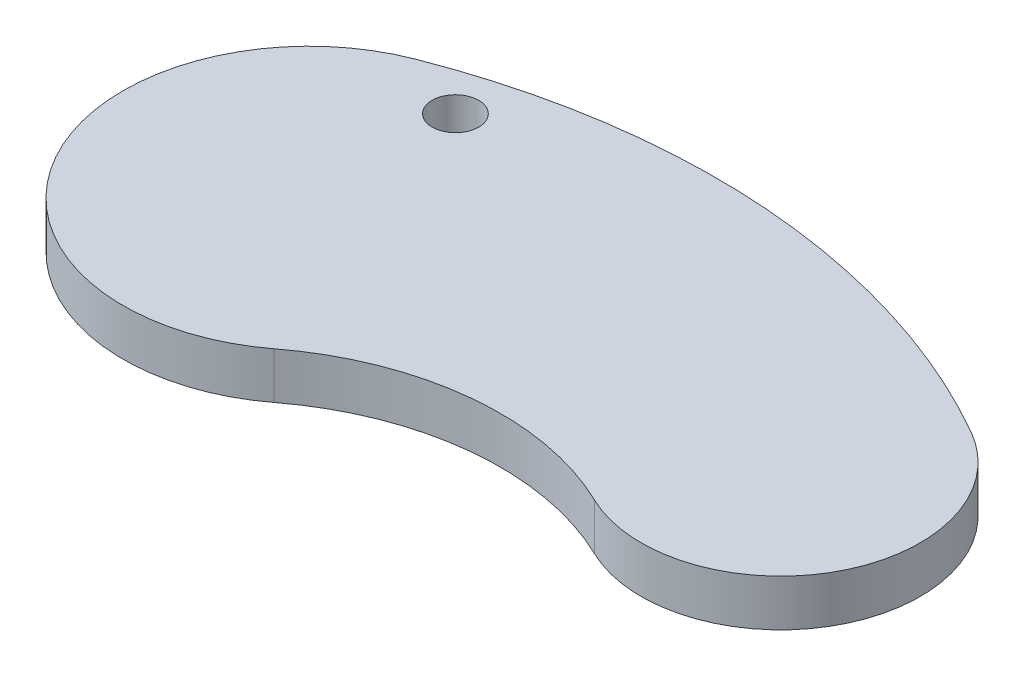
ISO-10303-21;
HEADER;
FILE_DESCRIPTION(('STEP AP214'),'2;1');
FILE_NAME('part.step','',(''),(''),'','','');
FILE_SCHEMA(('AUTOMOTIVE_DESIGN { 1 0 10303 214 1 1 1 1 }'));
ENDSEC;
DATA;
#1=APPLICATION_CONTEXT('core data for automotive mechanical design processes');
#2=APPLICATION_PROTOCOL_DEFINITION('international standard','automotive_design',2000,#1);
#3=PRODUCT_CONTEXT('',#1,'mechanical');
#4=PRODUCT('Part','Part','',(#3));
#5=PRODUCT_RELATED_PRODUCT_CATEGORY('part','',(#4));
#6=PRODUCT_DEFINITION_FORMATION('','',#4);
#7=PRODUCT_DEFINITION_CONTEXT('part definition',#1,'design');
#8=PRODUCT_DEFINITION('design','',#6,#7);
#9=PRODUCT_DEFINITION_SHAPE('','',#8);
#10=(LENGTH_UNIT() NAMED_UNIT(*) SI_UNIT(.MILLI.,.METRE.));
#11=(NAMED_UNIT(*) PLANE_ANGLE_UNIT() SI_UNIT($,.RADIAN.));
#12=(NAMED_UNIT(*) SI_UNIT($,.STERADIAN.) SOLID_ANGLE_UNIT());
#13=UNCERTAINTY_MEASURE_WITH_UNIT(LENGTH_MEASURE(1.E-05),#10,'distance_accuracy_value','');
#14=(GEOMETRIC_REPRESENTATION_CONTEXT(3) GLOBAL_UNCERTAINTY_ASSIGNED_CONTEXT((#13)) GLOBAL_UNIT_ASSIGNED_CONTEXT((#10,
#11,#12)) REPRESENTATION_CONTEXT('',''));
#15=CARTESIAN_POINT('',(0.,0.,0.));
#16=DIRECTION('',(0.,0.,1.));
#17=DIRECTION('',(1.,0.,0.));
#18=AXIS2_PLACEMENT_3D('',#15,#16,#17);
#19=CARTESIAN_POINT('',(199.810410977494,50.,512.421505857244));
#20=DIRECTION('',(0.,-1.,0.));
#21=DIRECTION('',(0.,0.,-1.));
#22=AXIS2_PLACEMENT_3D('',#19,#20,#21);
#23=CYLINDRICAL_SURFACE('',#22,750.);
#24=CARTESIAN_POINT('',(199.810410977494,0.,512.421505857244));
#25=DIRECTION('',(0.,1.,0.));
#26=DIRECTION('',(0.,0.,-1.));
#27=AXIS2_PLACEMENT_3D('',#24,#25,#26);
#28=CIRCLE('',#27,750.);
#29=CARTESIAN_POINT('',(573.958412065811,0.,-137.588704279195));
#30=VERTEX_POINT('',#29);
#31=CARTESIAN_POINT('',(-72.6583312645432,0.,-186.335093038998));
#32=VERTEX_POINT('',#31);
#33=EDGE_CURVE('E95',#30,#32,#28,.T.);
#34=ORIENTED_EDGE('',*,*,#33,.T.);
#35=DIRECTION('',(0.,-1.,0.));
#36=VECTOR('',#35,1.);
#37=CARTESIAN_POINT('',(-72.6583312645432,50.,-186.335093038998));
#38=LINE('',#37,#36);
#39=CARTESIAN_POINT('',(-72.6583312645432,50.,-186.335093038998));
#40=VERTEX_POINT('',#39);
#41=EDGE_CURVE('E11',#40,#32,#38,.T.);
#42=ORIENTED_EDGE('',*,*,#41,.F.);
#43=CARTESIAN_POINT('',(199.810410977494,50.,512.421505857244));
#44=DIRECTION('',(0.,1.,0.));
#45=DIRECTION('',(0.,0.,-1.));
#46=AXIS2_PLACEMENT_3D('',#43,#44,#45);
#47=CIRCLE('',#46,750.);
#48=CARTESIAN_POINT('',(573.958412065811,50.,-137.588704279195));
#49=VERTEX_POINT('',#48);
#50=EDGE_CURVE('E83',#49,#40,#47,.T.);
#51=ORIENTED_EDGE('',*,*,#50,.F.);
#52=DIRECTION('',(0.,-1.,0.));
#53=VECTOR('',#52,1.);
#54=CARTESIAN_POINT('',(573.958412065811,50.,-137.588704279195));
#55=LINE('',#54,#53);
#56=EDGE_CURVE('E91',#49,#30,#55,.T.);
#57=ORIENTED_EDGE('',*,*,#56,.T.);
#58=EDGE_LOOP('',(#34,#42,#51,#57));
#59=FACE_BOUND('',#58,.T.);
#60=ADVANCED_FACE('F32',(#59),#23,.T.);
#61=CARTESIAN_POINT('',(0.,50.,0.));
#62=DIRECTION('',(0.,-1.,0.));
#63=DIRECTION('',(0.,0.,-1.));
#64=AXIS2_PLACEMENT_3D('',#61,#62,#63);
#65=CYLINDRICAL_SURFACE('',#64,200.);
#66=CARTESIAN_POINT('',(0.,0.,0.));
#67=DIRECTION('',(0.,1.,0.));
#68=DIRECTION('',(0.,0.,1.));
#69=AXIS2_PLACEMENT_3D('',#66,#67,#68);
#70=CIRCLE('',#69,200.);
#71=CARTESIAN_POINT('',(121.299023103566,0.,159.017442421014));
#72=VERTEX_POINT('',#71);
#73=EDGE_CURVE('E87',#32,#72,#70,.T.);
#74=ORIENTED_EDGE('',*,*,#73,.T.);
#75=DIRECTION('',(0.,-1.,0.));
#76=VECTOR('',#75,1.);
#77=CARTESIAN_POINT('',(121.299023103566,50.,159.017442421014));
#78=LINE('',#77,#76);
#79=CARTESIAN_POINT('',(121.299023103566,50.,159.017442421014));
#80=VERTEX_POINT('',#79);
#81=EDGE_CURVE('E40',#80,#72,#78,.T.);
#82=ORIENTED_EDGE('',*,*,#81,.F.);
#83=CARTESIAN_POINT('',(0.,50.,0.));
#84=DIRECTION('',(0.,1.,0.));
#85=DIRECTION('',(0.,0.,1.));
#86=AXIS2_PLACEMENT_3D('',#83,#84,#85);
#87=CIRCLE('',#86,200.);
#88=EDGE_CURVE('E78',#40,#80,#87,.T.);
#89=ORIENTED_EDGE('',*,*,#88,.F.);
#90=ORIENTED_EDGE('',*,*,#41,.T.);
#91=EDGE_LOOP('',(#74,#82,#89,#90));
#92=FACE_BOUND('',#91,.T.);
#93=ADVANCED_FACE('F86',(#92),#65,.T.);
#94=CARTESIAN_POINT('',(303.247557758915,50.,397.543606052535));
#95=DIRECTION('',(0.,-1.,0.));
#96=DIRECTION('',(0.,0.,-1.));
#97=AXIS2_PLACEMENT_3D('',#94,#95,#96);
#98=CYLINDRICAL_SURFACE('',#97,300.);
#99=CARTESIAN_POINT('',(303.247557758915,0.,397.543606052535));
#100=DIRECTION('',(0.,-1.,0.));
#101=DIRECTION('',(0.,0.,-1.));
#102=AXIS2_PLACEMENT_3D('',#99,#100,#101);
#103=CIRCLE('',#102,300.);
#104=CARTESIAN_POINT('',(433.83506048507,0.,127.45676051624));
#105=VERTEX_POINT('',#104);
#106=EDGE_CURVE('E65',#72,#105,#103,.T.);
#107=ORIENTED_EDGE('',*,*,#106,.T.);
#108=DIRECTION('',(0.,-1.,0.));
#109=VECTOR('',#108,1.);
#110=CARTESIAN_POINT('',(433.83506048507,50.,127.45676051624));
#111=LINE('',#110,#109);
#112=CARTESIAN_POINT('',(433.83506048507,50.,127.45676051624));
#113=VERTEX_POINT('',#112);
#114=EDGE_CURVE('E88',#113,#105,#111,.T.);
#115=ORIENTED_EDGE('',*,*,#114,.F.);
#116=CARTESIAN_POINT('',(303.247557758915,50.,397.543606052535));
#117=DIRECTION('',(0.,-1.,0.));
#118=DIRECTION('',(0.,0.,-1.));
#119=AXIS2_PLACEMENT_3D('',#116,#117,#118);
#120=CIRCLE('',#119,300.);
#121=EDGE_CURVE('E81',#80,#113,#120,.T.);
#122=ORIENTED_EDGE('',*,*,#121,.F.);
#123=ORIENTED_EDGE('',*,*,#81,.T.);
#124=EDGE_LOOP('',(#107,#115,#122,#123));
#125=FACE_BOUND('',#124,.T.);
#126=ADVANCED_FACE('F89',(#125),#98,.F.);
#127=CARTESIAN_POINT('',(499.128811848147,50.,-7.58666225190716));
#128=DIRECTION('',(0.,-1.,0.));
#129=DIRECTION('',(0.,0.,-1.));
#130=AXIS2_PLACEMENT_3D('',#127,#128,#129);
#131=CYLINDRICAL_SURFACE('',#130,150.);
#132=CARTESIAN_POINT('',(499.128811848147,0.,-7.58666225190716));
#133=DIRECTION('',(0.,1.,0.));
#134=DIRECTION('',(0.,0.,1.));
#135=AXIS2_PLACEMENT_3D('',#132,#133,#134);
#136=CIRCLE('',#135,150.);
#137=EDGE_CURVE('E71',#105,#30,#136,.T.);
#138=ORIENTED_EDGE('',*,*,#137,.T.);
#139=ORIENTED_EDGE('',*,*,#56,.F.);
#140=CARTESIAN_POINT('',(499.128811848147,50.,-7.58666225190716));
#141=DIRECTION('',(0.,1.,0.));
#142=DIRECTION('',(0.,0.,1.));
#143=AXIS2_PLACEMENT_3D('',#140,#141,#142);
#144=CIRCLE('',#143,150.);
#145=EDGE_CURVE('E48',#113,#49,#144,.T.);
#146=ORIENTED_EDGE('',*,*,#145,.F.);
#147=ORIENTED_EDGE('',*,*,#114,.T.);
#148=EDGE_LOOP('',(#138,#139,#146,#147));
#149=FACE_BOUND('',#148,.T.);
#150=ADVANCED_FACE('F103',(#149),#131,.T.);
#151=CARTESIAN_POINT('',(349.469611412821,50.,252.417421802668));
#152=DIRECTION('',(0.,-1.,0.));
#153=DIRECTION('',(0.,0.,-1.));
#154=AXIS2_PLACEMENT_3D('',#151,#152,#153);
#155=PLANE('',#154);
#156=CARTESIAN_POINT('',(0.,50.,-157.158916996707));
#157=DIRECTION('',(0.,1.,0.));
#158=DIRECTION('',(0.,0.,1.));
#159=AXIS2_PLACEMENT_3D('',#156,#157,#158);
#160=CIRCLE('',#159,25.);
#161=CARTESIAN_POINT('',(0.,50.,-132.158916996707));
#162=VERTEX_POINT('',#161);
#163=EDGE_CURVE('E109',#162,#162,#160,.T.);
#164=ORIENTED_EDGE('',*,*,#163,.F.);
#165=EDGE_LOOP('',(#164));
#166=FACE_BOUND('',#165,.T.);
#167=ORIENTED_EDGE('',*,*,#50,.T.);
#168=ORIENTED_EDGE('',*,*,#88,.T.);
#169=ORIENTED_EDGE('',*,*,#121,.T.);
#170=ORIENTED_EDGE('',*,*,#145,.T.);
#171=EDGE_LOOP('',(#167,#168,#169,#170));
#172=FACE_BOUND('',#171,.T.);
#173=ADVANCED_FACE('F79',(#166,#172),#155,.F.);
#174=CARTESIAN_POINT('',(349.469611412821,0.,252.417421802668));
#175=DIRECTION('',(0.,-1.,0.));
#176=DIRECTION('',(0.,0.,-1.));
#177=AXIS2_PLACEMENT_3D('',#174,#175,#176);
#178=PLANE('',#177);
#179=CARTESIAN_POINT('',(0.,0.,-157.158916996707));
#180=DIRECTION('',(0.,1.,0.));
#181=DIRECTION('',(0.,0.,1.));
#182=AXIS2_PLACEMENT_3D('',#179,#180,#181);
#183=CIRCLE('',#182,25.);
#184=CARTESIAN_POINT('',(0.,0.,-132.158916996707));
#185=VERTEX_POINT('',#184);
#186=EDGE_CURVE('E98',#185,#185,#183,.T.);
#187=ORIENTED_EDGE('',*,*,#186,.T.);
#188=EDGE_LOOP('',(#187));
#189=FACE_BOUND('',#188,.T.);
#190=ORIENTED_EDGE('',*,*,#33,.F.);
#191=ORIENTED_EDGE('',*,*,#137,.F.);
#192=ORIENTED_EDGE('',*,*,#106,.F.);
#193=ORIENTED_EDGE('',*,*,#73,.F.);
#194=EDGE_LOOP('',(#190,#191,#192,#193));
#195=FACE_BOUND('',#194,.T.);
#196=ADVANCED_FACE('F106',(#189,#195),#178,.T.);
#197=CARTESIAN_POINT('',(0.,0.,-157.158916996707));
#198=DIRECTION('',(0.,1.,0.));
#199=DIRECTION('',(0.,0.,1.));
#200=AXIS2_PLACEMENT_3D('',#197,#198,#199);
#201=CYLINDRICAL_SURFACE('',#200,25.);
#202=ORIENTED_EDGE('',*,*,#186,.F.);
#203=EDGE_LOOP('',(#202));
#204=FACE_BOUND('',#203,.T.);
#205=ORIENTED_EDGE('',*,*,#163,.T.);
#206=EDGE_LOOP('',(#205));
#207=FACE_BOUND('',#206,.T.);
#208=ADVANCED_FACE('F116',(#204,#207),#201,.F.);
#209=CLOSED_SHELL('',(#60,#93,#126,#150,#173,#196,#208));
#210=MANIFOLD_SOLID_BREP('B2',#209);
#211=ADVANCED_BREP_SHAPE_REPRESENTATION('',(#18,#210),#14);
#212=SHAPE_DEFINITION_REPRESENTATION(#9,#211);
ENDSEC;
END-ISO-10303-21;
